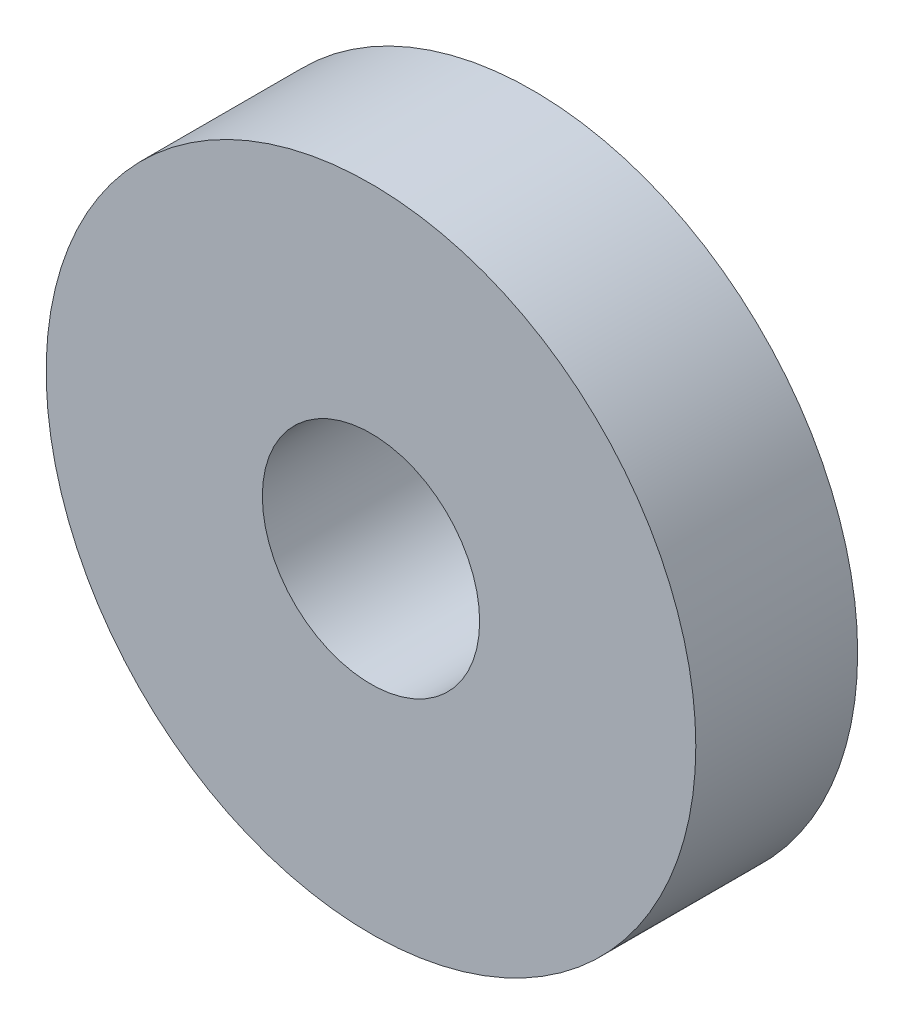
ISO-10303-21;
HEADER;
FILE_DESCRIPTION(('STEP AP214'),'2;1');
FILE_NAME('part.step','',(''),(''),'','','');
FILE_SCHEMA(('AUTOMOTIVE_DESIGN { 1 0 10303 214 1 1 1 1 }'));
ENDSEC;
DATA;
#1=APPLICATION_CONTEXT('core data for automotive mechanical design processes');
#2=APPLICATION_PROTOCOL_DEFINITION('international standard','automotive_design',2000,#1);
#3=PRODUCT_CONTEXT('',#1,'mechanical');
#4=PRODUCT('Part','Part','',(#3));
#5=PRODUCT_RELATED_PRODUCT_CATEGORY('part','',(#4));
#6=PRODUCT_DEFINITION_FORMATION('','',#4);
#7=PRODUCT_DEFINITION_CONTEXT('part definition',#1,'design');
#8=PRODUCT_DEFINITION('design','',#6,#7);
#9=PRODUCT_DEFINITION_SHAPE('','',#8);
#10=(LENGTH_UNIT() NAMED_UNIT(*) SI_UNIT(.MILLI.,.METRE.));
#11=(NAMED_UNIT(*) PLANE_ANGLE_UNIT() SI_UNIT($,.RADIAN.));
#12=(NAMED_UNIT(*) SI_UNIT($,.STERADIAN.) SOLID_ANGLE_UNIT());
#13=UNCERTAINTY_MEASURE_WITH_UNIT(LENGTH_MEASURE(1.E-05),#10,'distance_accuracy_value','');
#14=(GEOMETRIC_REPRESENTATION_CONTEXT(3) GLOBAL_UNCERTAINTY_ASSIGNED_CONTEXT((#13)) GLOBAL_UNIT_ASSIGNED_CONTEXT((#10,
#11,#12)) REPRESENTATION_CONTEXT('',''));
#15=CARTESIAN_POINT('',(0.,0.,0.));
#16=DIRECTION('',(0.,0.,1.));
#17=DIRECTION('',(1.,0.,0.));
#18=AXIS2_PLACEMENT_3D('',#15,#16,#17);
#19=CARTESIAN_POINT('',(0.,0.,-3.556));
#20=DIRECTION('',(0.,0.,1.));
#21=DIRECTION('',(1.,0.,0.));
#22=AXIS2_PLACEMENT_3D('',#19,#20,#21);
#23=CYLINDRICAL_SURFACE('',#22,7.1374);
#24=CARTESIAN_POINT('',(0.,0.,-3.556));
#25=DIRECTION('',(0.,0.,1.));
#26=DIRECTION('',(1.,0.,0.));
#27=AXIS2_PLACEMENT_3D('',#24,#25,#26);
#28=CIRCLE('',#27,7.1374);
#29=CARTESIAN_POINT('',(7.1374,0.,-3.556));
#30=VERTEX_POINT('',#29);
#31=EDGE_CURVE('E10',#30,#30,#28,.T.);
#32=ORIENTED_EDGE('',*,*,#31,.T.);
#33=EDGE_LOOP('',(#32));
#34=FACE_BOUND('',#33,.T.);
#35=CARTESIAN_POINT('',(0.,0.,0.));
#36=DIRECTION('',(0.,0.,1.));
#37=DIRECTION('',(1.,0.,0.));
#38=AXIS2_PLACEMENT_3D('',#35,#36,#37);
#39=CIRCLE('',#38,7.1374);
#40=CARTESIAN_POINT('',(7.1374,0.,0.));
#41=VERTEX_POINT('',#40);
#42=EDGE_CURVE('E33',#41,#41,#39,.T.);
#43=ORIENTED_EDGE('',*,*,#42,.F.);
#44=EDGE_LOOP('',(#43));
#45=FACE_BOUND('',#44,.T.);
#46=ADVANCED_FACE('F30',(#34,#45),#23,.T.);
#47=CARTESIAN_POINT('',(0.,0.,-3.556));
#48=DIRECTION('',(0.,0.,1.));
#49=DIRECTION('',(1.,0.,0.));
#50=AXIS2_PLACEMENT_3D('',#47,#48,#49);
#51=PLANE('',#50);
#52=CARTESIAN_POINT('',(0.,0.,-3.556));
#53=DIRECTION('',(0.,0.,1.));
#54=DIRECTION('',(1.,0.,0.));
#55=AXIS2_PLACEMENT_3D('',#52,#53,#54);
#56=CIRCLE('',#55,2.3876);
#57=CARTESIAN_POINT('',(2.3876,0.,-3.556));
#58=VERTEX_POINT('',#57);
#59=EDGE_CURVE('E40',#58,#58,#56,.T.);
#60=ORIENTED_EDGE('',*,*,#59,.T.);
#61=EDGE_LOOP('',(#60));
#62=FACE_BOUND('',#61,.T.);
#63=ORIENTED_EDGE('',*,*,#31,.F.);
#64=EDGE_LOOP('',(#63));
#65=FACE_BOUND('',#64,.T.);
#66=ADVANCED_FACE('F48',(#62,#65),#51,.F.);
#67=CARTESIAN_POINT('',(0.,0.,0.));
#68=DIRECTION('',(0.,0.,1.));
#69=DIRECTION('',(1.,0.,0.));
#70=AXIS2_PLACEMENT_3D('',#67,#68,#69);
#71=PLANE('',#70);
#72=CARTESIAN_POINT('',(0.,0.,0.));
#73=DIRECTION('',(0.,0.,1.));
#74=DIRECTION('',(1.,0.,0.));
#75=AXIS2_PLACEMENT_3D('',#72,#73,#74);
#76=CIRCLE('',#75,2.3876);
#77=CARTESIAN_POINT('',(2.3876,0.,0.));
#78=VERTEX_POINT('',#77);
#79=EDGE_CURVE('E42',#78,#78,#76,.T.);
#80=ORIENTED_EDGE('',*,*,#79,.F.);
#81=EDGE_LOOP('',(#80));
#82=FACE_BOUND('',#81,.T.);
#83=ORIENTED_EDGE('',*,*,#42,.T.);
#84=EDGE_LOOP('',(#83));
#85=FACE_BOUND('',#84,.T.);
#86=ADVANCED_FACE('F54',(#82,#85),#71,.T.);
#87=CARTESIAN_POINT('',(0.,0.,-3.556));
#88=DIRECTION('',(0.,0.,1.));
#89=DIRECTION('',(1.,0.,0.));
#90=AXIS2_PLACEMENT_3D('',#87,#88,#89);
#91=CYLINDRICAL_SURFACE('',#90,2.3876);
#92=ORIENTED_EDGE('',*,*,#59,.F.);
#93=EDGE_LOOP('',(#92));
#94=FACE_BOUND('',#93,.T.);
#95=ORIENTED_EDGE('',*,*,#79,.T.);
#96=EDGE_LOOP('',(#95));
#97=FACE_BOUND('',#96,.T.);
#98=ADVANCED_FACE('F51',(#94,#97),#91,.F.);
#99=CLOSED_SHELL('',(#46,#66,#86,#98));
#100=MANIFOLD_SOLID_BREP('B2',#99);
#101=ADVANCED_BREP_SHAPE_REPRESENTATION('',(#18,#100),#14);
#102=SHAPE_DEFINITION_REPRESENTATION(#9,#101);
ENDSEC;
END-ISO-10303-21;
